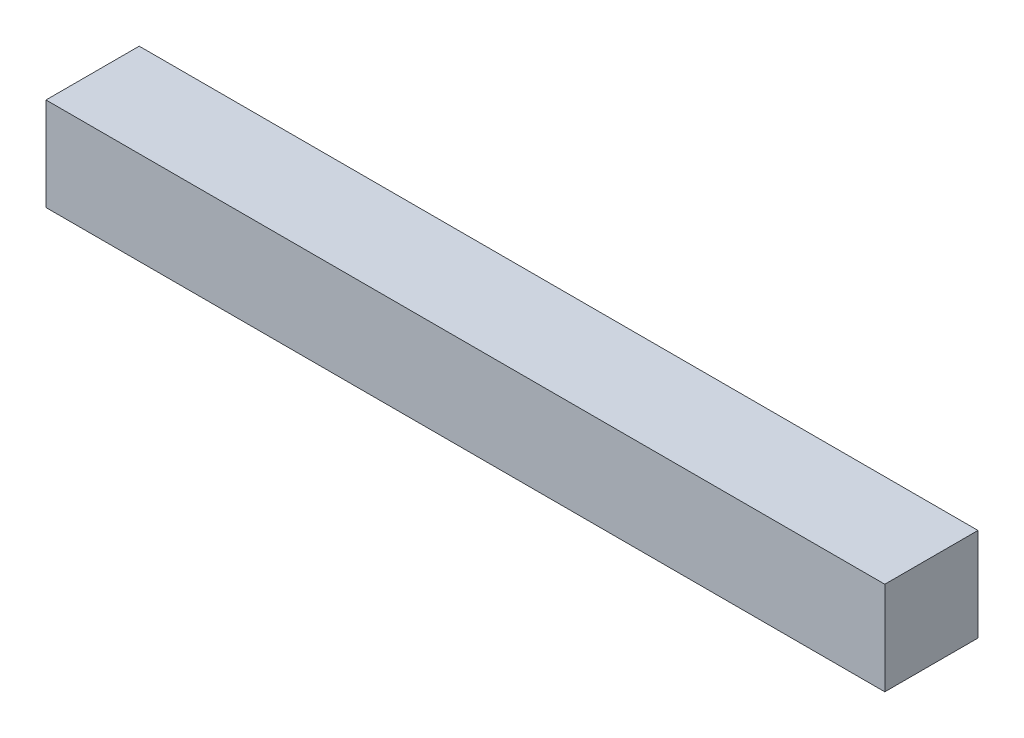
ISO-10303-21;
HEADER;
FILE_DESCRIPTION(('STEP AP214'),'2;1');
FILE_NAME('part.step','',(''),(''),'','','');
FILE_SCHEMA(('AUTOMOTIVE_DESIGN { 1 0 10303 214 1 1 1 1 }'));
ENDSEC;
DATA;
#1=APPLICATION_CONTEXT('core data for automotive mechanical design processes');
#2=APPLICATION_PROTOCOL_DEFINITION('international standard','automotive_design',2000,#1);
#3=PRODUCT_CONTEXT('',#1,'mechanical');
#4=PRODUCT('Part','Part','',(#3));
#5=PRODUCT_RELATED_PRODUCT_CATEGORY('part','',(#4));
#6=PRODUCT_DEFINITION_FORMATION('','',#4);
#7=PRODUCT_DEFINITION_CONTEXT('part definition',#1,'design');
#8=PRODUCT_DEFINITION('design','',#6,#7);
#9=PRODUCT_DEFINITION_SHAPE('','',#8);
#10=(LENGTH_UNIT() NAMED_UNIT(*) SI_UNIT(.MILLI.,.METRE.));
#11=(NAMED_UNIT(*) PLANE_ANGLE_UNIT() SI_UNIT($,.RADIAN.));
#12=(NAMED_UNIT(*) SI_UNIT($,.STERADIAN.) SOLID_ANGLE_UNIT());
#13=UNCERTAINTY_MEASURE_WITH_UNIT(LENGTH_MEASURE(1.E-05),#10,'distance_accuracy_value','');
#14=(GEOMETRIC_REPRESENTATION_CONTEXT(3) GLOBAL_UNCERTAINTY_ASSIGNED_CONTEXT((#13)) GLOBAL_UNIT_ASSIGNED_CONTEXT((#10,
#11,#12)) REPRESENTATION_CONTEXT('',''));
#15=CARTESIAN_POINT('',(0.,0.,0.));
#16=DIRECTION('',(0.,0.,1.));
#17=DIRECTION('',(1.,0.,0.));
#18=AXIS2_PLACEMENT_3D('',#15,#16,#17);
#19=CARTESIAN_POINT('',(114.3,25.4,12.7));
#20=DIRECTION('',(-1.,0.,0.));
#21=DIRECTION('',(0.,0.,1.));
#22=AXIS2_PLACEMENT_3D('',#19,#20,#21);
#23=PLANE('',#22);
#24=DIRECTION('',(0.,0.,-1.));
#25=VECTOR('',#24,1.);
#26=CARTESIAN_POINT('',(114.3,0.,12.7));
#27=LINE('',#26,#25);
#28=CARTESIAN_POINT('',(114.3,0.,12.7));
#29=VERTEX_POINT('',#28);
#30=CARTESIAN_POINT('',(114.3,0.,-12.7));
#31=VERTEX_POINT('',#30);
#32=EDGE_CURVE('E107',#29,#31,#27,.T.);
#33=ORIENTED_EDGE('',*,*,#32,.T.);
#34=DIRECTION('',(0.,-1.,0.));
#35=VECTOR('',#34,1.);
#36=CARTESIAN_POINT('',(114.3,25.4,-12.7));
#37=LINE('',#36,#35);
#38=CARTESIAN_POINT('',(114.3,25.4,-12.7));
#39=VERTEX_POINT('',#38);
#40=EDGE_CURVE('E11',#39,#31,#37,.T.);
#41=ORIENTED_EDGE('',*,*,#40,.F.);
#42=DIRECTION('',(0.,0.,-1.));
#43=VECTOR('',#42,1.);
#44=CARTESIAN_POINT('',(114.3,25.4,12.7));
#45=LINE('',#44,#43);
#46=CARTESIAN_POINT('',(114.3,25.4,12.7));
#47=VERTEX_POINT('',#46);
#48=EDGE_CURVE('E91',#47,#39,#45,.T.);
#49=ORIENTED_EDGE('',*,*,#48,.F.);
#50=DIRECTION('',(0.,-1.,0.));
#51=VECTOR('',#50,1.);
#52=CARTESIAN_POINT('',(114.3,25.4,12.7));
#53=LINE('',#52,#51);
#54=EDGE_CURVE('E103',#47,#29,#53,.T.);
#55=ORIENTED_EDGE('',*,*,#54,.T.);
#56=EDGE_LOOP('',(#33,#41,#49,#55));
#57=FACE_BOUND('',#56,.T.);
#58=ADVANCED_FACE('F39',(#57),#23,.F.);
#59=CARTESIAN_POINT('',(-114.3,25.4,-12.7));
#60=DIRECTION('',(0.,0.,1.));
#61=DIRECTION('',(1.,0.,0.));
#62=AXIS2_PLACEMENT_3D('',#59,#60,#61);
#63=PLANE('',#62);
#64=DIRECTION('',(-1.,0.,0.));
#65=VECTOR('',#64,1.);
#66=CARTESIAN_POINT('',(-114.3,0.,-12.7));
#67=LINE('',#66,#65);
#68=CARTESIAN_POINT('',(-114.3,0.,-12.7));
#69=VERTEX_POINT('',#68);
#70=EDGE_CURVE('E96',#31,#69,#67,.T.);
#71=ORIENTED_EDGE('',*,*,#70,.T.);
#72=DIRECTION('',(0.,-1.,0.));
#73=VECTOR('',#72,1.);
#74=CARTESIAN_POINT('',(-114.3,25.4,-12.7));
#75=LINE('',#74,#73);
#76=CARTESIAN_POINT('',(-114.3,25.4,-12.7));
#77=VERTEX_POINT('',#76);
#78=EDGE_CURVE('E48',#77,#69,#75,.T.);
#79=ORIENTED_EDGE('',*,*,#78,.F.);
#80=DIRECTION('',(-1.,0.,0.));
#81=VECTOR('',#80,1.);
#82=CARTESIAN_POINT('',(-114.3,25.4,-12.7));
#83=LINE('',#82,#81);
#84=EDGE_CURVE('E86',#39,#77,#83,.T.);
#85=ORIENTED_EDGE('',*,*,#84,.F.);
#86=ORIENTED_EDGE('',*,*,#40,.T.);
#87=EDGE_LOOP('',(#71,#79,#85,#86));
#88=FACE_BOUND('',#87,.T.);
#89=ADVANCED_FACE('F95',(#88),#63,.F.);
#90=CARTESIAN_POINT('',(-114.3,25.4,12.7));
#91=DIRECTION('',(1.,0.,0.));
#92=DIRECTION('',(0.,0.,-1.));
#93=AXIS2_PLACEMENT_3D('',#90,#91,#92);
#94=PLANE('',#93);
#95=DIRECTION('',(0.,0.,1.));
#96=VECTOR('',#95,1.);
#97=CARTESIAN_POINT('',(-114.3,0.,12.7));
#98=LINE('',#97,#96);
#99=CARTESIAN_POINT('',(-114.3,0.,12.7));
#100=VERTEX_POINT('',#99);
#101=EDGE_CURVE('E73',#69,#100,#98,.T.);
#102=ORIENTED_EDGE('',*,*,#101,.T.);
#103=DIRECTION('',(0.,-1.,0.));
#104=VECTOR('',#103,1.);
#105=CARTESIAN_POINT('',(-114.3,25.4,12.7));
#106=LINE('',#105,#104);
#107=CARTESIAN_POINT('',(-114.3,25.4,12.7));
#108=VERTEX_POINT('',#107);
#109=EDGE_CURVE('E98',#108,#100,#106,.T.);
#110=ORIENTED_EDGE('',*,*,#109,.F.);
#111=DIRECTION('',(0.,0.,1.));
#112=VECTOR('',#111,1.);
#113=CARTESIAN_POINT('',(-114.3,25.4,12.7));
#114=LINE('',#113,#112);
#115=EDGE_CURVE('E89',#77,#108,#114,.T.);
#116=ORIENTED_EDGE('',*,*,#115,.F.);
#117=ORIENTED_EDGE('',*,*,#78,.T.);
#118=EDGE_LOOP('',(#102,#110,#116,#117));
#119=FACE_BOUND('',#118,.T.);
#120=ADVANCED_FACE('F99',(#119),#94,.F.);
#121=CARTESIAN_POINT('',(-114.3,25.4,12.7));
#122=DIRECTION('',(0.,0.,-1.));
#123=DIRECTION('',(-1.,0.,0.));
#124=AXIS2_PLACEMENT_3D('',#121,#122,#123);
#125=PLANE('',#124);
#126=DIRECTION('',(1.,0.,0.));
#127=VECTOR('',#126,1.);
#128=CARTESIAN_POINT('',(-114.3,0.,12.7));
#129=LINE('',#128,#127);
#130=EDGE_CURVE('E79',#100,#29,#129,.T.);
#131=ORIENTED_EDGE('',*,*,#130,.T.);
#132=ORIENTED_EDGE('',*,*,#54,.F.);
#133=DIRECTION('',(1.,0.,0.));
#134=VECTOR('',#133,1.);
#135=CARTESIAN_POINT('',(-114.3,25.4,12.7));
#136=LINE('',#135,#134);
#137=EDGE_CURVE('E56',#108,#47,#136,.T.);
#138=ORIENTED_EDGE('',*,*,#137,.F.);
#139=ORIENTED_EDGE('',*,*,#109,.T.);
#140=EDGE_LOOP('',(#131,#132,#138,#139));
#141=FACE_BOUND('',#140,.T.);
#142=ADVANCED_FACE('F120',(#141),#125,.F.);
#143=CARTESIAN_POINT('',(0.,25.4,0.));
#144=DIRECTION('',(0.,-1.,0.));
#145=DIRECTION('',(0.,0.,-1.));
#146=AXIS2_PLACEMENT_3D('',#143,#144,#145);
#147=PLANE('',#146);
#148=ORIENTED_EDGE('',*,*,#48,.T.);
#149=ORIENTED_EDGE('',*,*,#84,.T.);
#150=ORIENTED_EDGE('',*,*,#115,.T.);
#151=ORIENTED_EDGE('',*,*,#137,.T.);
#152=EDGE_LOOP('',(#148,#149,#150,#151));
#153=FACE_BOUND('',#152,.T.);
#154=ADVANCED_FACE('F87',(#153),#147,.F.);
#155=CARTESIAN_POINT('',(0.,0.,0.));
#156=DIRECTION('',(0.,-1.,0.));
#157=DIRECTION('',(0.,0.,-1.));
#158=AXIS2_PLACEMENT_3D('',#155,#156,#157);
#159=PLANE('',#158);
#160=ORIENTED_EDGE('',*,*,#32,.F.);
#161=ORIENTED_EDGE('',*,*,#130,.F.);
#162=ORIENTED_EDGE('',*,*,#101,.F.);
#163=ORIENTED_EDGE('',*,*,#70,.F.);
#164=EDGE_LOOP('',(#160,#161,#162,#163));
#165=FACE_BOUND('',#164,.T.);
#166=ADVANCED_FACE('F123',(#165),#159,.T.);
#167=CLOSED_SHELL('',(#58,#89,#120,#142,#154,#166));
#168=MANIFOLD_SOLID_BREP('B2',#167);
#169=ADVANCED_BREP_SHAPE_REPRESENTATION('',(#18,#168),#14);
#170=SHAPE_DEFINITION_REPRESENTATION(#9,#169);
ENDSEC;
END-ISO-10303-21;
